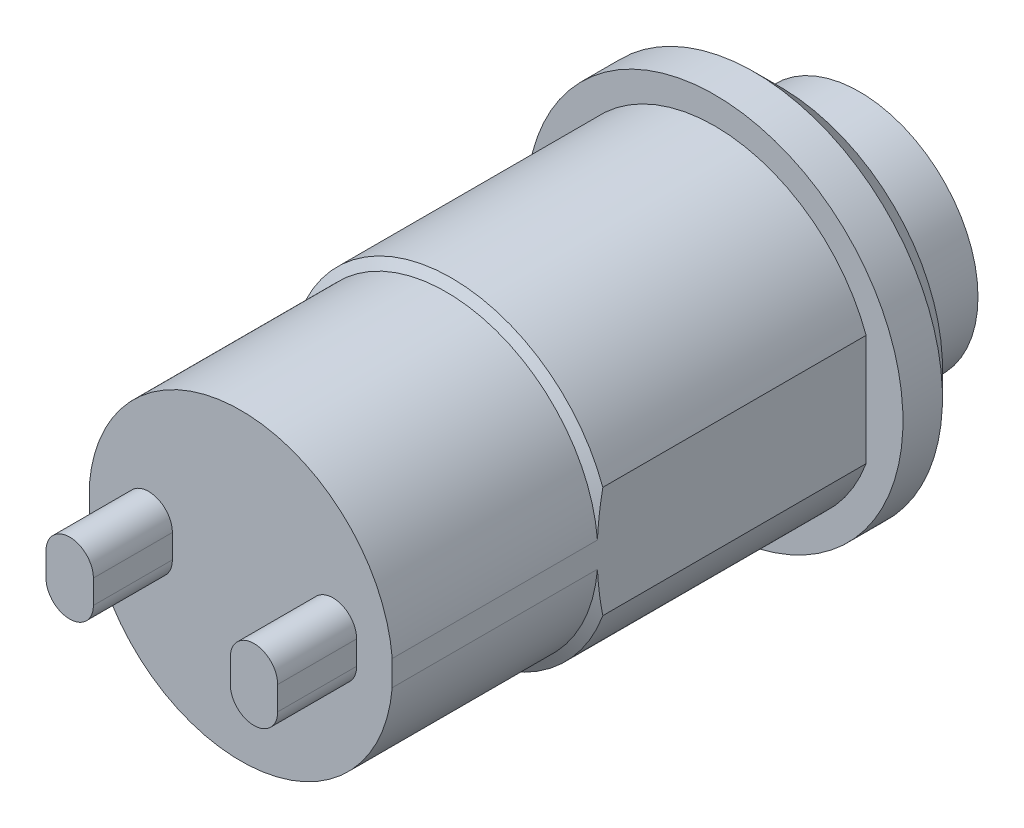
ISO-10303-21;
HEADER;
FILE_DESCRIPTION(('STEP AP214'),'2;1');
FILE_NAME('part.step','',(''),(''),'','','');
FILE_SCHEMA(('AUTOMOTIVE_DESIGN { 1 0 10303 214 1 1 1 1 }'));
ENDSEC;
DATA;
#1=APPLICATION_CONTEXT('core data for automotive mechanical design processes');
#2=APPLICATION_PROTOCOL_DEFINITION('international standard','automotive_design',2000,#1);
#3=PRODUCT_CONTEXT('',#1,'mechanical');
#4=PRODUCT('Part','Part','',(#3));
#5=PRODUCT_RELATED_PRODUCT_CATEGORY('part','',(#4));
#6=PRODUCT_DEFINITION_FORMATION('','',#4);
#7=PRODUCT_DEFINITION_CONTEXT('part definition',#1,'design');
#8=PRODUCT_DEFINITION('design','',#6,#7);
#9=PRODUCT_DEFINITION_SHAPE('','',#8);
#10=(LENGTH_UNIT() NAMED_UNIT(*) SI_UNIT(.MILLI.,.METRE.));
#11=(NAMED_UNIT(*) PLANE_ANGLE_UNIT() SI_UNIT($,.RADIAN.));
#12=(NAMED_UNIT(*) SI_UNIT($,.STERADIAN.) SOLID_ANGLE_UNIT());
#13=UNCERTAINTY_MEASURE_WITH_UNIT(LENGTH_MEASURE(1.E-05),#10,'distance_accuracy_value','');
#14=(GEOMETRIC_REPRESENTATION_CONTEXT(3) GLOBAL_UNCERTAINTY_ASSIGNED_CONTEXT((#13)) GLOBAL_UNIT_ASSIGNED_CONTEXT((#10,
#11,#12)) REPRESENTATION_CONTEXT('',''));
#15=CARTESIAN_POINT('',(0.,0.,0.));
#16=DIRECTION('',(0.,0.,1.));
#17=DIRECTION('',(1.,0.,0.));
#18=AXIS2_PLACEMENT_3D('',#15,#16,#17);
#19=CARTESIAN_POINT('',(0.,0.,-49.6568329421243));
#20=DIRECTION('',(0.,0.,-1.));
#21=DIRECTION('',(-1.,0.,0.));
#22=AXIS2_PLACEMENT_3D('',#19,#20,#21);
#23=CYLINDRICAL_SURFACE('',#22,6.12500000000001);
#24=CARTESIAN_POINT('',(0.,0.,10.));
#25=DIRECTION('',(0.,0.,-1.));
#26=DIRECTION('',(-1.,0.,0.));
#27=AXIS2_PLACEMENT_3D('',#24,#25,#26);
#28=CIRCLE('',#27,6.12500000000001);
#29=CARTESIAN_POINT('',(-5.75,2.11024287701679,10.));
#30=VERTEX_POINT('',#29);
#31=CARTESIAN_POINT('',(5.75,2.11024287701679,10.));
#32=VERTEX_POINT('',#31);
#33=EDGE_CURVE('E181',#30,#32,#28,.T.);
#34=ORIENTED_EDGE('',*,*,#33,.T.);
#35=DIRECTION('',(0.,0.,1.));
#36=VECTOR('',#35,1.);
#37=CARTESIAN_POINT('',(5.75,2.11024287701679,-4.2371128141696));
#38=LINE('',#37,#36);
#39=CARTESIAN_POINT('',(5.75,2.11024287701679,0.));
#40=VERTEX_POINT('',#39);
#41=EDGE_CURVE('E167',#40,#32,#38,.T.);
#42=ORIENTED_EDGE('',*,*,#41,.F.);
#43=CARTESIAN_POINT('',(0.,0.,0.));
#44=DIRECTION('',(0.,0.,-1.));
#45=DIRECTION('',(-1.,0.,0.));
#46=AXIS2_PLACEMENT_3D('',#43,#44,#45);
#47=CIRCLE('',#46,6.12500000000001);
#48=CARTESIAN_POINT('',(-5.75,2.11024287701679,0.));
#49=VERTEX_POINT('',#48);
#50=EDGE_CURVE('E176',#49,#40,#47,.T.);
#51=ORIENTED_EDGE('',*,*,#50,.F.);
#52=DIRECTION('',(0.,0.,1.));
#53=VECTOR('',#52,1.);
#54=CARTESIAN_POINT('',(-5.75,2.11024287701679,-4.2371128141696));
#55=LINE('',#54,#53);
#56=EDGE_CURVE('E584',#49,#30,#55,.T.);
#57=ORIENTED_EDGE('',*,*,#56,.T.);
#58=EDGE_LOOP('',(#34,#42,#51,#57));
#59=FACE_BOUND('',#58,.T.);
#60=ADVANCED_FACE('F45',(#59),#23,.T.);
#61=CARTESIAN_POINT('',(0.,0.,10.2049593455623));
#62=DIRECTION('',(0.,0.,-1.));
#63=DIRECTION('',(-1.,0.,0.));
#64=AXIS2_PLACEMENT_3D('',#61,#62,#63);
#65=CONICAL_SURFACE('',#64,5.77000000000001,1.04719755119661);
#66=CARTESIAN_POINT('',(5.75,-2.11024287701679,10.));
#67=VERTEX_POINT('',#66);
#68=CARTESIAN_POINT('',(-5.75,-2.11024287701679,10.));
#69=VERTEX_POINT('',#68);
#70=EDGE_CURVE('E185',#67,#69,#28,.T.);
#71=ORIENTED_EDGE('',*,*,#70,.F.);
#72=CARTESIAN_POINT('',(5.75,-2.11094287701679,9.99986073972885));
#73=CARTESIAN_POINT('',(5.75,-1.97362625151507,10.0271913681319));
#74=CARTESIAN_POINT('',(5.75,-1.83584357008723,10.0522492398615));
#75=CARTESIAN_POINT('',(5.75,-1.55944069758245,10.0974319539955));
#76=CARTESIAN_POINT('',(5.75,-1.42082031733226,10.1175556359621));
#77=CARTESIAN_POINT('',(5.75,-1.14284252177679,10.1524766254936));
#78=CARTESIAN_POINT('',(5.75,-1.00348481953381,10.1672716766164));
#79=CARTESIAN_POINT('',(5.75,-0.724303795555837,10.1912228123099));
#80=CARTESIAN_POINT('',(5.75,-0.584480516138516,10.20037939603));
#81=CARTESIAN_POINT('',(5.75,-0.168948851655554,10.2188503830837));
#82=CARTESIAN_POINT('',(5.75,0.107184374453622,10.2197253485683));
#83=CARTESIAN_POINT('',(5.75,0.658394032800849,10.1985909668815));
#84=CARTESIAN_POINT('',(5.75,0.933470993550755,10.1765951564037));
#85=CARTESIAN_POINT('',(5.75,1.28280194150757,10.1351644665691));
#86=CARTESIAN_POINT('',(5.75,1.35829659132565,10.1254001697001));
#87=CARTESIAN_POINT('',(5.75,1.50906621154096,10.1043398016968));
#88=CARTESIAN_POINT('',(5.75,1.58434120759044,10.0930439173938));
#89=CARTESIAN_POINT('',(5.75,1.73498529824519,10.0689269990814));
#90=CARTESIAN_POINT('',(5.75,1.81035334481151,10.0560994612025));
#91=CARTESIAN_POINT('',(5.75,1.96084025697072,10.0290264309476));
#92=CARTESIAN_POINT('',(5.75,2.03595910384655,10.014780834448));
#93=CARTESIAN_POINT('',(5.75,2.11094287701679,9.99986073972885));
#94=B_SPLINE_CURVE_WITH_KNOTS('',3,(#72,#73,#74,#75,#76,#77,#78,#79,#80,#81,#82,#83,#84,#85,#86,
#87,#88,#89,#90,#91,#92,#93),.UNSPECIFIED.,.F.,.F.,(4,2,2,2,2,2,2,2,2,2,4),(0.,
0.420030554474528,0.840159798478734,1.26046674025352,1.68073646869493,2.50812065878773,
3.33501541755115,3.56337896676642,3.79171468396149,4.02105698408979,4.25041613655785),.UNSPECIFIED.);
#95=CARTESIAN_POINT('',(5.75,-0.480000000000096,10.2049593455623));
#96=VERTEX_POINT('',#95);
#97=EDGE_CURVE('E162',#67,#96,#94,.T.);
#98=ORIENTED_EDGE('',*,*,#97,.T.);
#99=CARTESIAN_POINT('',(0.,0.,10.2049593455623));
#100=DIRECTION('',(0.,0.,-1.));
#101=DIRECTION('',(-1.,0.,0.));
#102=AXIS2_PLACEMENT_3D('',#99,#100,#101);
#103=CIRCLE('',#102,5.77000000000001);
#104=CARTESIAN_POINT('',(-5.75,-0.480000000000096,10.2049593455623));
#105=VERTEX_POINT('',#104);
#106=EDGE_CURVE('E202',#96,#105,#103,.T.);
#107=ORIENTED_EDGE('',*,*,#106,.T.);
#108=CARTESIAN_POINT('',(-5.75,2.11094287701679,9.99986073972885));
#109=CARTESIAN_POINT('',(-5.75,1.97362625151507,10.0271913681319));
#110=CARTESIAN_POINT('',(-5.75,1.83584357008723,10.0522492398615));
#111=CARTESIAN_POINT('',(-5.75,1.55944069758245,10.0974319539955));
#112=CARTESIAN_POINT('',(-5.75,1.42082031733226,10.1175556359621));
#113=CARTESIAN_POINT('',(-5.75,1.14284252177679,10.1524766254936));
#114=CARTESIAN_POINT('',(-5.75,1.00348481953381,10.1672716766164));
#115=CARTESIAN_POINT('',(-5.75,0.724303795555837,10.1912228123099));
#116=CARTESIAN_POINT('',(-5.75,0.584480516138516,10.20037939603));
#117=CARTESIAN_POINT('',(-5.75,0.168948851655554,10.2188503830837));
#118=CARTESIAN_POINT('',(-5.75,-0.107184374453622,10.2197253485683));
#119=CARTESIAN_POINT('',(-5.75,-0.658394032800849,10.1985909668815));
#120=CARTESIAN_POINT('',(-5.75,-0.933470993550755,10.1765951564037));
#121=CARTESIAN_POINT('',(-5.75,-1.28280194150757,10.1351644665691));
#122=CARTESIAN_POINT('',(-5.75,-1.35829659132565,10.1254001697001));
#123=CARTESIAN_POINT('',(-5.75,-1.50906621154096,10.1043398016968));
#124=CARTESIAN_POINT('',(-5.75,-1.58434120759044,10.0930439173938));
#125=CARTESIAN_POINT('',(-5.75,-1.73498529824519,10.0689269990814));
#126=CARTESIAN_POINT('',(-5.75,-1.81035334481151,10.0560994612025));
#127=CARTESIAN_POINT('',(-5.75,-1.96084025697072,10.0290264309476));
#128=CARTESIAN_POINT('',(-5.75,-2.03595910384655,10.014780834448));
#129=CARTESIAN_POINT('',(-5.75,-2.11094287701679,9.99986073972885));
#130=B_SPLINE_CURVE_WITH_KNOTS('',3,(#108,#109,#110,#111,#112,#113,#114,#115,#116,#117,#118,
#119,#120,#121,#122,#123,#124,#125,#126,#127,#128,#129),.UNSPECIFIED.,.F.,.F.,(4,2,2,2,2,2,2,2,
2,2,4),(0.,0.420030554474528,0.840159798478734,1.26046674025352,1.68073646869493,
2.50812065878773,3.33501541755115,3.56337896676642,3.79171468396149,4.02105698408979,
4.25041613655785),.UNSPECIFIED.);
#131=EDGE_CURVE('E224',#105,#69,#130,.T.);
#132=ORIENTED_EDGE('',*,*,#131,.T.);
#133=EDGE_LOOP('',(#71,#98,#107,#132));
#134=FACE_BOUND('',#133,.T.);
#135=ADVANCED_FACE('F223',(#134),#65,.T.);
#136=CARTESIAN_POINT('',(0.,0.,-49.6568329421243));
#137=DIRECTION('',(0.,0.,-1.));
#138=DIRECTION('',(-1.,0.,0.));
#139=AXIS2_PLACEMENT_3D('',#136,#137,#138);
#140=CYLINDRICAL_SURFACE('',#139,5.77000000000001);
#141=CARTESIAN_POINT('',(0.,0.,18.));
#142=DIRECTION('',(0.,0.,-1.));
#143=DIRECTION('',(-1.,0.,0.));
#144=AXIS2_PLACEMENT_3D('',#141,#142,#143);
#145=CIRCLE('',#144,5.77000000000001);
#146=CARTESIAN_POINT('',(-5.75,0.480000000000096,18.));
#147=VERTEX_POINT('',#146);
#148=CARTESIAN_POINT('',(5.75,0.480000000000096,18.));
#149=VERTEX_POINT('',#148);
#150=EDGE_CURVE('E208',#147,#149,#145,.T.);
#151=ORIENTED_EDGE('',*,*,#150,.T.);
#152=DIRECTION('',(0.,0.,-1.));
#153=VECTOR('',#152,1.);
#154=CARTESIAN_POINT('',(5.75,0.480000000000096,-49.6568329421243));
#155=LINE('',#154,#153);
#156=CARTESIAN_POINT('',(5.75,0.480000000000096,10.2049593455623));
#157=VERTEX_POINT('',#156);
#158=EDGE_CURVE('E11',#149,#157,#155,.T.);
#159=ORIENTED_EDGE('',*,*,#158,.T.);
#160=CARTESIAN_POINT('',(-5.75,0.480000000000096,10.2049593455623));
#161=VERTEX_POINT('',#160);
#162=EDGE_CURVE('E215',#161,#157,#103,.T.);
#163=ORIENTED_EDGE('',*,*,#162,.F.);
#164=DIRECTION('',(0.,0.,-1.));
#165=VECTOR('',#164,1.);
#166=CARTESIAN_POINT('',(-5.75,0.480000000000096,-49.6568329421243));
#167=LINE('',#166,#165);
#168=EDGE_CURVE('E191',#161,#147,#167,.F.);
#169=ORIENTED_EDGE('',*,*,#168,.T.);
#170=EDGE_LOOP('',(#151,#159,#163,#169));
#171=FACE_BOUND('',#170,.T.);
#172=ADVANCED_FACE('F312',(#171),#140,.T.);
#173=CARTESIAN_POINT('',(5.77000000000001,0.,18.));
#174=DIRECTION('',(0.,0.,-1.));
#175=DIRECTION('',(-1.,0.,0.));
#176=AXIS2_PLACEMENT_3D('',#173,#174,#175);
#177=PLANE('',#176);
#178=DIRECTION('',(0.,-1.,0.));
#179=VECTOR('',#178,1.);
#180=CARTESIAN_POINT('',(-2.6,-0.45,18.));
#181=LINE('',#180,#179);
#182=CARTESIAN_POINT('',(-2.6,0.45,18.));
#183=VERTEX_POINT('',#182);
#184=CARTESIAN_POINT('',(-2.6,-0.45,18.));
#185=VERTEX_POINT('',#184);
#186=EDGE_CURVE('E402',#183,#185,#181,.T.);
#187=ORIENTED_EDGE('',*,*,#186,.T.);
#188=CARTESIAN_POINT('',(-3.5,-0.45,18.));
#189=DIRECTION('',(0.,0.,-1.));
#190=DIRECTION('',(-1.,0.,0.));
#191=AXIS2_PLACEMENT_3D('',#188,#189,#190);
#192=CIRCLE('',#191,0.899999999999999);
#193=CARTESIAN_POINT('',(-4.4,-0.45,18.));
#194=VERTEX_POINT('',#193);
#195=EDGE_CURVE('E227',#185,#194,#192,.T.);
#196=ORIENTED_EDGE('',*,*,#195,.T.);
#197=DIRECTION('',(0.,1.,0.));
#198=VECTOR('',#197,1.);
#199=CARTESIAN_POINT('',(-4.4,-0.45,18.));
#200=LINE('',#199,#198);
#201=CARTESIAN_POINT('',(-4.4,0.45,18.));
#202=VERTEX_POINT('',#201);
#203=EDGE_CURVE('E396',#194,#202,#200,.T.);
#204=ORIENTED_EDGE('',*,*,#203,.T.);
#205=CARTESIAN_POINT('',(-3.5,0.45,18.));
#206=DIRECTION('',(0.,0.,-1.));
#207=DIRECTION('',(-1.,0.,0.));
#208=AXIS2_PLACEMENT_3D('',#205,#206,#207);
#209=CIRCLE('',#208,0.899999999999999);
#210=EDGE_CURVE('E399',#202,#183,#209,.T.);
#211=ORIENTED_EDGE('',*,*,#210,.T.);
#212=EDGE_LOOP('',(#187,#196,#204,#211));
#213=FACE_BOUND('',#212,.T.);
#214=CARTESIAN_POINT('',(5.75,-0.480000000000096,18.));
#215=VERTEX_POINT('',#214);
#216=CARTESIAN_POINT('',(-5.75,-0.480000000000096,18.));
#217=VERTEX_POINT('',#216);
#218=EDGE_CURVE('E200',#215,#217,#145,.T.);
#219=ORIENTED_EDGE('',*,*,#218,.F.);
#220=DIRECTION('',(0.,-1.,0.));
#221=VECTOR('',#220,1.);
#222=CARTESIAN_POINT('',(5.75,2.11024287701679,18.));
#223=LINE('',#222,#221);
#224=EDGE_CURVE('E60',#149,#215,#223,.T.);
#225=ORIENTED_EDGE('',*,*,#224,.F.);
#226=ORIENTED_EDGE('',*,*,#150,.F.);
#227=DIRECTION('',(0.,1.,0.));
#228=VECTOR('',#227,1.);
#229=CARTESIAN_POINT('',(-5.75,2.11024287701679,18.));
#230=LINE('',#229,#228);
#231=EDGE_CURVE('E68',#217,#147,#230,.T.);
#232=ORIENTED_EDGE('',*,*,#231,.F.);
#233=EDGE_LOOP('',(#219,#225,#226,#232));
#234=FACE_BOUND('',#233,.T.);
#235=CARTESIAN_POINT('',(3.5,-0.45,18.));
#236=DIRECTION('',(0.,0.,1.));
#237=DIRECTION('',(1.,0.,0.));
#238=AXIS2_PLACEMENT_3D('',#235,#236,#237);
#239=CIRCLE('',#238,0.899999999999999);
#240=CARTESIAN_POINT('',(2.6,-0.45,18.));
#241=VERTEX_POINT('',#240);
#242=CARTESIAN_POINT('',(4.4,-0.45,18.));
#243=VERTEX_POINT('',#242);
#244=EDGE_CURVE('E376',#241,#243,#239,.T.);
#245=ORIENTED_EDGE('',*,*,#244,.F.);
#246=DIRECTION('',(0.,-1.,0.));
#247=VECTOR('',#246,1.);
#248=CARTESIAN_POINT('',(2.6,-0.45,18.));
#249=LINE('',#248,#247);
#250=CARTESIAN_POINT('',(2.6,0.45,18.));
#251=VERTEX_POINT('',#250);
#252=EDGE_CURVE('E366',#251,#241,#249,.T.);
#253=ORIENTED_EDGE('',*,*,#252,.F.);
#254=CARTESIAN_POINT('',(3.5,0.45,18.));
#255=DIRECTION('',(0.,0.,1.));
#256=DIRECTION('',(1.,0.,0.));
#257=AXIS2_PLACEMENT_3D('',#254,#255,#256);
#258=CIRCLE('',#257,0.899999999999999);
#259=CARTESIAN_POINT('',(4.4,0.45,18.));
#260=VERTEX_POINT('',#259);
#261=EDGE_CURVE('E370',#260,#251,#258,.T.);
#262=ORIENTED_EDGE('',*,*,#261,.F.);
#263=DIRECTION('',(0.,1.,0.));
#264=VECTOR('',#263,1.);
#265=CARTESIAN_POINT('',(4.4,-0.45,18.));
#266=LINE('',#265,#264);
#267=EDGE_CURVE('E373',#243,#260,#266,.T.);
#268=ORIENTED_EDGE('',*,*,#267,.F.);
#269=EDGE_LOOP('',(#245,#253,#262,#268));
#270=FACE_BOUND('',#269,.T.);
#271=ADVANCED_FACE('F204',(#213,#234,#270),#177,.F.);
#272=CARTESIAN_POINT('',(0.,0.,-49.6568329421243));
#273=DIRECTION('',(0.,0.,-1.));
#274=DIRECTION('',(-1.,0.,0.));
#275=AXIS2_PLACEMENT_3D('',#272,#273,#274);
#276=CYLINDRICAL_SURFACE('',#275,7.15);
#277=CARTESIAN_POINT('',(0.,0.,-1.5));
#278=DIRECTION('',(0.,0.,-1.));
#279=DIRECTION('',(-1.,0.,0.));
#280=AXIS2_PLACEMENT_3D('',#277,#278,#279);
#281=CIRCLE('',#280,7.15);
#282=CARTESIAN_POINT('',(-7.15,0.,-1.5));
#283=VERTEX_POINT('',#282);
#284=EDGE_CURVE('E341',#283,#283,#281,.T.);
#285=ORIENTED_EDGE('',*,*,#284,.F.);
#286=EDGE_LOOP('',(#285));
#287=FACE_BOUND('',#286,.T.);
#288=CARTESIAN_POINT('',(0.,0.,0.));
#289=DIRECTION('',(0.,0.,-1.));
#290=DIRECTION('',(-1.,0.,0.));
#291=AXIS2_PLACEMENT_3D('',#288,#289,#290);
#292=CIRCLE('',#291,7.15);
#293=CARTESIAN_POINT('',(-7.15,0.,0.));
#294=VERTEX_POINT('',#293);
#295=EDGE_CURVE('E183',#294,#294,#292,.T.);
#296=ORIENTED_EDGE('',*,*,#295,.T.);
#297=EDGE_LOOP('',(#296));
#298=FACE_BOUND('',#297,.T.);
#299=ADVANCED_FACE('F47',(#287,#298),#276,.T.);
#300=CARTESIAN_POINT('',(7.15,0.,0.));
#301=DIRECTION('',(0.,0.,-1.));
#302=DIRECTION('',(-1.,0.,0.));
#303=AXIS2_PLACEMENT_3D('',#300,#301,#302);
#304=PLANE('',#303);
#305=ORIENTED_EDGE('',*,*,#295,.F.);
#306=EDGE_LOOP('',(#305));
#307=FACE_BOUND('',#306,.T.);
#308=ORIENTED_EDGE('',*,*,#50,.T.);
#309=DIRECTION('',(0.,-1.,0.));
#310=VECTOR('',#309,1.);
#311=CARTESIAN_POINT('',(5.75,2.11024287701679,0.));
#312=LINE('',#311,#310);
#313=CARTESIAN_POINT('',(5.75,-2.11024287701679,0.));
#314=VERTEX_POINT('',#313);
#315=EDGE_CURVE('E159',#40,#314,#312,.T.);
#316=ORIENTED_EDGE('',*,*,#315,.T.);
#317=CARTESIAN_POINT('',(-5.75,-2.11024287701679,0.));
#318=VERTEX_POINT('',#317);
#319=EDGE_CURVE('E174',#314,#318,#47,.T.);
#320=ORIENTED_EDGE('',*,*,#319,.T.);
#321=DIRECTION('',(0.,1.,0.));
#322=VECTOR('',#321,1.);
#323=CARTESIAN_POINT('',(-5.75,2.11024287701679,0.));
#324=LINE('',#323,#322);
#325=EDGE_CURVE('E589',#318,#49,#324,.T.);
#326=ORIENTED_EDGE('',*,*,#325,.T.);
#327=EDGE_LOOP('',(#308,#316,#320,#326));
#328=FACE_BOUND('',#327,.T.);
#329=ADVANCED_FACE('F172',(#307,#328),#304,.F.);
#330=ORIENTED_EDGE('',*,*,#319,.F.);
#331=DIRECTION('',(0.,0.,1.));
#332=VECTOR('',#331,1.);
#333=CARTESIAN_POINT('',(5.75,-2.11024287701679,-4.2371128141696));
#334=LINE('',#333,#332);
#335=EDGE_CURVE('E156',#314,#67,#334,.T.);
#336=ORIENTED_EDGE('',*,*,#335,.T.);
#337=ORIENTED_EDGE('',*,*,#70,.T.);
#338=DIRECTION('',(0.,0.,1.));
#339=VECTOR('',#338,1.);
#340=CARTESIAN_POINT('',(-5.75,-2.11024287701679,-4.2371128141696));
#341=LINE('',#340,#339);
#342=EDGE_CURVE('E180',#318,#69,#341,.T.);
#343=ORIENTED_EDGE('',*,*,#342,.F.);
#344=EDGE_LOOP('',(#330,#336,#337,#343));
#345=FACE_BOUND('',#344,.T.);
#346=ADVANCED_FACE('F179',(#345),#23,.T.);
#347=ORIENTED_EDGE('',*,*,#162,.T.);
#348=EDGE_CURVE('E225',#157,#32,#94,.T.);
#349=ORIENTED_EDGE('',*,*,#348,.T.);
#350=ORIENTED_EDGE('',*,*,#33,.F.);
#351=EDGE_CURVE('E228',#30,#161,#130,.T.);
#352=ORIENTED_EDGE('',*,*,#351,.T.);
#353=EDGE_LOOP('',(#347,#349,#350,#352));
#354=FACE_BOUND('',#353,.T.);
#355=ADVANCED_FACE('F245',(#354),#65,.T.);
#356=ORIENTED_EDGE('',*,*,#106,.F.);
#357=DIRECTION('',(0.,0.,-1.));
#358=VECTOR('',#357,1.);
#359=CARTESIAN_POINT('',(5.75,-0.480000000000096,-49.6568329421243));
#360=LINE('',#359,#358);
#361=EDGE_CURVE('E53',#96,#215,#360,.F.);
#362=ORIENTED_EDGE('',*,*,#361,.T.);
#363=ORIENTED_EDGE('',*,*,#218,.T.);
#364=DIRECTION('',(0.,0.,-1.));
#365=VECTOR('',#364,1.);
#366=CARTESIAN_POINT('',(-5.75,-0.480000000000096,-49.6568329421243));
#367=LINE('',#366,#365);
#368=EDGE_CURVE('E193',#217,#105,#367,.T.);
#369=ORIENTED_EDGE('',*,*,#368,.T.);
#370=EDGE_LOOP('',(#356,#362,#363,#369));
#371=FACE_BOUND('',#370,.T.);
#372=ADVANCED_FACE('F199',(#371),#140,.T.);
#373=CARTESIAN_POINT('',(0.,0.,11.0750000000001));
#374=DIRECTION('',(0.,0.,-1.));
#375=DIRECTION('',(1.,0.,0.));
#376=AXIS2_PLACEMENT_3D('',#373,#374,#375);
#377=SPHERICAL_SURFACE('',#376,17.1750000000001);
#378=CARTESIAN_POINT('',(0.,0.,-5.50000000000001));
#379=DIRECTION('',(0.,0.,-1.));
#380=DIRECTION('',(-1.,0.,0.));
#381=AXIS2_PLACEMENT_3D('',#378,#379,#380);
#382=CIRCLE('',#381,4.5);
#383=CARTESIAN_POINT('',(-4.5,0.,-5.50000000000001));
#384=VERTEX_POINT('',#383);
#385=EDGE_CURVE('E209',#384,#384,#382,.T.);
#386=ORIENTED_EDGE('',*,*,#385,.T.);
#387=EDGE_LOOP('',(#386));
#388=FACE_BOUND('',#387,.T.);
#389=ADVANCED_FACE('F306',(#388),#377,.T.);
#390=CARTESIAN_POINT('',(0.,0.,-49.6568329421243));
#391=DIRECTION('',(0.,0.,-1.));
#392=DIRECTION('',(-1.,0.,0.));
#393=AXIS2_PLACEMENT_3D('',#390,#391,#392);
#394=CYLINDRICAL_SURFACE('',#393,4.5);
#395=ORIENTED_EDGE('',*,*,#385,.F.);
#396=EDGE_LOOP('',(#395));
#397=FACE_BOUND('',#396,.T.);
#398=CARTESIAN_POINT('',(0.,0.,-2.5));
#399=DIRECTION('',(0.,0.,-1.));
#400=DIRECTION('',(-1.,0.,0.));
#401=AXIS2_PLACEMENT_3D('',#398,#399,#400);
#402=CIRCLE('',#401,4.5);
#403=CARTESIAN_POINT('',(-4.5,0.,-2.5));
#404=VERTEX_POINT('',#403);
#405=EDGE_CURVE('E212',#404,#404,#402,.T.);
#406=ORIENTED_EDGE('',*,*,#405,.T.);
#407=EDGE_LOOP('',(#406));
#408=FACE_BOUND('',#407,.T.);
#409=ADVANCED_FACE('F302',(#397,#408),#394,.T.);
#410=CARTESIAN_POINT('',(6.15,0.,-2.5));
#411=DIRECTION('',(0.,0.,1.));
#412=DIRECTION('',(1.,0.,0.));
#413=AXIS2_PLACEMENT_3D('',#410,#411,#412);
#414=PLANE('',#413);
#415=ORIENTED_EDGE('',*,*,#405,.F.);
#416=EDGE_LOOP('',(#415));
#417=FACE_BOUND('',#416,.T.);
#418=CARTESIAN_POINT('',(0.,0.,-2.5));
#419=DIRECTION('',(0.,0.,-1.));
#420=DIRECTION('',(-1.,0.,0.));
#421=AXIS2_PLACEMENT_3D('',#418,#419,#420);
#422=CIRCLE('',#421,6.15);
#423=CARTESIAN_POINT('',(-6.15,0.,-2.5));
#424=VERTEX_POINT('',#423);
#425=EDGE_CURVE('E343',#424,#424,#422,.T.);
#426=ORIENTED_EDGE('',*,*,#425,.T.);
#427=EDGE_LOOP('',(#426));
#428=FACE_BOUND('',#427,.T.);
#429=ADVANCED_FACE('F298',(#417,#428),#414,.F.);
#430=CARTESIAN_POINT('',(0.,0.,-1.5));
#431=DIRECTION('',(0.,0.,1.));
#432=DIRECTION('',(1.,0.,0.));
#433=AXIS2_PLACEMENT_3D('',#430,#431,#432);
#434=CONICAL_SURFACE('',#433,7.15,0.78539816339745);
#435=ORIENTED_EDGE('',*,*,#425,.F.);
#436=EDGE_LOOP('',(#435));
#437=FACE_BOUND('',#436,.T.);
#438=ORIENTED_EDGE('',*,*,#284,.T.);
#439=EDGE_LOOP('',(#438));
#440=FACE_BOUND('',#439,.T.);
#441=ADVANCED_FACE('F294',(#437,#440),#434,.T.);
#442=CARTESIAN_POINT('',(3.5,-0.45,21.));
#443=DIRECTION('',(0.,0.,-1.));
#444=DIRECTION('',(-1.,0.,0.));
#445=AXIS2_PLACEMENT_3D('',#442,#443,#444);
#446=CYLINDRICAL_SURFACE('',#445,0.899999999999999);
#447=ORIENTED_EDGE('',*,*,#244,.T.);
#448=DIRECTION('',(0.,0.,-1.));
#449=VECTOR('',#448,1.);
#450=CARTESIAN_POINT('',(4.4,-0.45,21.));
#451=LINE('',#450,#449);
#452=CARTESIAN_POINT('',(4.4,-0.45,21.));
#453=VERTEX_POINT('',#452);
#454=EDGE_CURVE('E344',#453,#243,#451,.T.);
#455=ORIENTED_EDGE('',*,*,#454,.F.);
#456=CARTESIAN_POINT('',(3.5,-0.45,21.));
#457=DIRECTION('',(0.,0.,1.));
#458=DIRECTION('',(1.,0.,0.));
#459=AXIS2_PLACEMENT_3D('',#456,#457,#458);
#460=CIRCLE('',#459,0.899999999999999);
#461=CARTESIAN_POINT('',(2.6,-0.45,21.));
#462=VERTEX_POINT('',#461);
#463=EDGE_CURVE('E369',#462,#453,#460,.T.);
#464=ORIENTED_EDGE('',*,*,#463,.F.);
#465=DIRECTION('',(0.,0.,-1.));
#466=VECTOR('',#465,1.);
#467=CARTESIAN_POINT('',(2.6,-0.45,21.));
#468=LINE('',#467,#466);
#469=EDGE_CURVE('E362',#462,#241,#468,.T.);
#470=ORIENTED_EDGE('',*,*,#469,.T.);
#471=EDGE_LOOP('',(#447,#455,#464,#470));
#472=FACE_BOUND('',#471,.T.);
#473=ADVANCED_FACE('F290',(#472),#446,.T.);
#474=CARTESIAN_POINT('',(4.4,-0.45,21.));
#475=DIRECTION('',(-1.,0.,0.));
#476=DIRECTION('',(0.,0.,1.));
#477=AXIS2_PLACEMENT_3D('',#474,#475,#476);
#478=PLANE('',#477);
#479=ORIENTED_EDGE('',*,*,#267,.T.);
#480=DIRECTION('',(0.,0.,-1.));
#481=VECTOR('',#480,1.);
#482=CARTESIAN_POINT('',(4.4,0.45,21.));
#483=LINE('',#482,#481);
#484=CARTESIAN_POINT('',(4.4,0.45,21.));
#485=VERTEX_POINT('',#484);
#486=EDGE_CURVE('E349',#485,#260,#483,.T.);
#487=ORIENTED_EDGE('',*,*,#486,.F.);
#488=DIRECTION('',(0.,1.,0.));
#489=VECTOR('',#488,1.);
#490=CARTESIAN_POINT('',(4.4,-0.45,21.));
#491=LINE('',#490,#489);
#492=EDGE_CURVE('E383',#453,#485,#491,.T.);
#493=ORIENTED_EDGE('',*,*,#492,.F.);
#494=ORIENTED_EDGE('',*,*,#454,.T.);
#495=EDGE_LOOP('',(#479,#487,#493,#494));
#496=FACE_BOUND('',#495,.T.);
#497=ADVANCED_FACE('F286',(#496),#478,.F.);
#498=CARTESIAN_POINT('',(3.5,0.45,21.));
#499=DIRECTION('',(0.,0.,-1.));
#500=DIRECTION('',(-1.,0.,0.));
#501=AXIS2_PLACEMENT_3D('',#498,#499,#500);
#502=CYLINDRICAL_SURFACE('',#501,0.899999999999999);
#503=ORIENTED_EDGE('',*,*,#261,.T.);
#504=DIRECTION('',(0.,0.,-1.));
#505=VECTOR('',#504,1.);
#506=CARTESIAN_POINT('',(2.6,0.45,21.));
#507=LINE('',#506,#505);
#508=CARTESIAN_POINT('',(2.6,0.45,21.));
#509=VERTEX_POINT('',#508);
#510=EDGE_CURVE('E359',#509,#251,#507,.T.);
#511=ORIENTED_EDGE('',*,*,#510,.F.);
#512=CARTESIAN_POINT('',(3.5,0.45,21.));
#513=DIRECTION('',(0.,0.,1.));
#514=DIRECTION('',(1.,0.,0.));
#515=AXIS2_PLACEMENT_3D('',#512,#513,#514);
#516=CIRCLE('',#515,0.899999999999999);
#517=EDGE_CURVE('E381',#485,#509,#516,.T.);
#518=ORIENTED_EDGE('',*,*,#517,.F.);
#519=ORIENTED_EDGE('',*,*,#486,.T.);
#520=EDGE_LOOP('',(#503,#511,#518,#519));
#521=FACE_BOUND('',#520,.T.);
#522=ADVANCED_FACE('F282',(#521),#502,.T.);
#523=CARTESIAN_POINT('',(2.6,-0.45,21.));
#524=DIRECTION('',(1.,0.,0.));
#525=DIRECTION('',(0.,0.,-1.));
#526=AXIS2_PLACEMENT_3D('',#523,#524,#525);
#527=PLANE('',#526);
#528=ORIENTED_EDGE('',*,*,#252,.T.);
#529=ORIENTED_EDGE('',*,*,#469,.F.);
#530=DIRECTION('',(0.,-1.,0.));
#531=VECTOR('',#530,1.);
#532=CARTESIAN_POINT('',(2.6,-0.45,21.));
#533=LINE('',#532,#531);
#534=EDGE_CURVE('E365',#509,#462,#533,.T.);
#535=ORIENTED_EDGE('',*,*,#534,.F.);
#536=ORIENTED_EDGE('',*,*,#510,.T.);
#537=EDGE_LOOP('',(#528,#529,#535,#536));
#538=FACE_BOUND('',#537,.T.);
#539=ADVANCED_FACE('F278',(#538),#527,.F.);
#540=CARTESIAN_POINT('',(3.5,-0.45,21.));
#541=DIRECTION('',(0.,0.,1.));
#542=DIRECTION('',(1.,0.,0.));
#543=AXIS2_PLACEMENT_3D('',#540,#541,#542);
#544=PLANE('',#543);
#545=ORIENTED_EDGE('',*,*,#463,.T.);
#546=ORIENTED_EDGE('',*,*,#492,.T.);
#547=ORIENTED_EDGE('',*,*,#517,.T.);
#548=ORIENTED_EDGE('',*,*,#534,.T.);
#549=EDGE_LOOP('',(#545,#546,#547,#548));
#550=FACE_BOUND('',#549,.T.);
#551=ADVANCED_FACE('F274',(#550),#544,.T.);
#552=CARTESIAN_POINT('',(-3.5,-0.45,21.));
#553=DIRECTION('',(0.,0.,-1.));
#554=DIRECTION('',(-1.,0.,0.));
#555=AXIS2_PLACEMENT_3D('',#552,#553,#554);
#556=CYLINDRICAL_SURFACE('',#555,0.899999999999999);
#557=ORIENTED_EDGE('',*,*,#195,.F.);
#558=DIRECTION('',(0.,0.,-1.));
#559=VECTOR('',#558,1.);
#560=CARTESIAN_POINT('',(-2.6,-0.45,21.));
#561=LINE('',#560,#559);
#562=CARTESIAN_POINT('',(-2.6,-0.45,21.));
#563=VERTEX_POINT('',#562);
#564=EDGE_CURVE('E379',#563,#185,#561,.T.);
#565=ORIENTED_EDGE('',*,*,#564,.F.);
#566=CARTESIAN_POINT('',(-3.5,-0.45,21.));
#567=DIRECTION('',(0.,0.,-1.));
#568=DIRECTION('',(-1.,0.,0.));
#569=AXIS2_PLACEMENT_3D('',#566,#567,#568);
#570=CIRCLE('',#569,0.899999999999999);
#571=CARTESIAN_POINT('',(-4.4,-0.45,21.));
#572=VERTEX_POINT('',#571);
#573=EDGE_CURVE('E243',#563,#572,#570,.T.);
#574=ORIENTED_EDGE('',*,*,#573,.T.);
#575=DIRECTION('',(0.,0.,-1.));
#576=VECTOR('',#575,1.);
#577=CARTESIAN_POINT('',(-4.4,-0.45,21.));
#578=LINE('',#577,#576);
#579=EDGE_CURVE('E393',#572,#194,#578,.T.);
#580=ORIENTED_EDGE('',*,*,#579,.T.);
#581=EDGE_LOOP('',(#557,#565,#574,#580));
#582=FACE_BOUND('',#581,.T.);
#583=ADVANCED_FACE('F270',(#582),#556,.T.);
#584=CARTESIAN_POINT('',(-2.6,-0.45,21.));
#585=DIRECTION('',(1.,0.,0.));
#586=DIRECTION('',(0.,0.,-1.));
#587=AXIS2_PLACEMENT_3D('',#584,#585,#586);
#588=PLANE('',#587);
#589=ORIENTED_EDGE('',*,*,#186,.F.);
#590=DIRECTION('',(0.,0.,-1.));
#591=VECTOR('',#590,1.);
#592=CARTESIAN_POINT('',(-2.6,0.45,21.));
#593=LINE('',#592,#591);
#594=CARTESIAN_POINT('',(-2.6,0.45,21.));
#595=VERTEX_POINT('',#594);
#596=EDGE_CURVE('E388',#595,#183,#593,.T.);
#597=ORIENTED_EDGE('',*,*,#596,.F.);
#598=DIRECTION('',(0.,-1.,0.));
#599=VECTOR('',#598,1.);
#600=CARTESIAN_POINT('',(-2.6,-0.45,21.));
#601=LINE('',#600,#599);
#602=EDGE_CURVE('E411',#595,#563,#601,.T.);
#603=ORIENTED_EDGE('',*,*,#602,.T.);
#604=ORIENTED_EDGE('',*,*,#564,.T.);
#605=EDGE_LOOP('',(#589,#597,#603,#604));
#606=FACE_BOUND('',#605,.T.);
#607=ADVANCED_FACE('F266',(#606),#588,.T.);
#608=CARTESIAN_POINT('',(-3.5,0.45,21.));
#609=DIRECTION('',(0.,0.,-1.));
#610=DIRECTION('',(-1.,0.,0.));
#611=AXIS2_PLACEMENT_3D('',#608,#609,#610);
#612=CYLINDRICAL_SURFACE('',#611,0.899999999999999);
#613=ORIENTED_EDGE('',*,*,#210,.F.);
#614=DIRECTION('',(0.,0.,-1.));
#615=VECTOR('',#614,1.);
#616=CARTESIAN_POINT('',(-4.4,0.45,21.));
#617=LINE('',#616,#615);
#618=CARTESIAN_POINT('',(-4.4,0.45,21.));
#619=VERTEX_POINT('',#618);
#620=EDGE_CURVE('E390',#619,#202,#617,.T.);
#621=ORIENTED_EDGE('',*,*,#620,.F.);
#622=CARTESIAN_POINT('',(-3.5,0.45,21.));
#623=DIRECTION('',(0.,0.,-1.));
#624=DIRECTION('',(-1.,0.,0.));
#625=AXIS2_PLACEMENT_3D('',#622,#623,#624);
#626=CIRCLE('',#625,0.899999999999999);
#627=EDGE_CURVE('E409',#619,#595,#626,.T.);
#628=ORIENTED_EDGE('',*,*,#627,.T.);
#629=ORIENTED_EDGE('',*,*,#596,.T.);
#630=EDGE_LOOP('',(#613,#621,#628,#629));
#631=FACE_BOUND('',#630,.T.);
#632=ADVANCED_FACE('F262',(#631),#612,.T.);
#633=CARTESIAN_POINT('',(-4.4,-0.45,21.));
#634=DIRECTION('',(-1.,0.,0.));
#635=DIRECTION('',(0.,0.,1.));
#636=AXIS2_PLACEMENT_3D('',#633,#634,#635);
#637=PLANE('',#636);
#638=ORIENTED_EDGE('',*,*,#203,.F.);
#639=ORIENTED_EDGE('',*,*,#579,.F.);
#640=DIRECTION('',(0.,1.,0.));
#641=VECTOR('',#640,1.);
#642=CARTESIAN_POINT('',(-4.4,-0.45,21.));
#643=LINE('',#642,#641);
#644=EDGE_CURVE('E395',#572,#619,#643,.T.);
#645=ORIENTED_EDGE('',*,*,#644,.T.);
#646=ORIENTED_EDGE('',*,*,#620,.T.);
#647=EDGE_LOOP('',(#638,#639,#645,#646));
#648=FACE_BOUND('',#647,.T.);
#649=ADVANCED_FACE('F258',(#648),#637,.T.);
#650=CARTESIAN_POINT('',(-3.5,-0.45,21.));
#651=DIRECTION('',(0.,0.,1.));
#652=DIRECTION('',(-1.,0.,0.));
#653=AXIS2_PLACEMENT_3D('',#650,#651,#652);
#654=PLANE('',#653);
#655=ORIENTED_EDGE('',*,*,#573,.F.);
#656=ORIENTED_EDGE('',*,*,#602,.F.);
#657=ORIENTED_EDGE('',*,*,#627,.F.);
#658=ORIENTED_EDGE('',*,*,#644,.F.);
#659=EDGE_LOOP('',(#655,#656,#657,#658));
#660=FACE_BOUND('',#659,.T.);
#661=ADVANCED_FACE('F255',(#660),#654,.T.);
#662=CARTESIAN_POINT('',(-5.75,2.11024287701679,-4.2371128141696));
#663=DIRECTION('',(1.,0.,0.));
#664=DIRECTION('',(0.,0.,-1.));
#665=AXIS2_PLACEMENT_3D('',#662,#663,#664);
#666=PLANE('',#665);
#667=ORIENTED_EDGE('',*,*,#368,.F.);
#668=ORIENTED_EDGE('',*,*,#231,.T.);
#669=ORIENTED_EDGE('',*,*,#168,.F.);
#670=ORIENTED_EDGE('',*,*,#351,.F.);
#671=ORIENTED_EDGE('',*,*,#56,.F.);
#672=ORIENTED_EDGE('',*,*,#325,.F.);
#673=ORIENTED_EDGE('',*,*,#342,.T.);
#674=ORIENTED_EDGE('',*,*,#131,.F.);
#675=EDGE_LOOP('',(#667,#668,#669,#670,#671,#672,#673,#674));
#676=FACE_BOUND('',#675,.T.);
#677=ADVANCED_FACE('F251',(#676),#666,.F.);
#678=CARTESIAN_POINT('',(5.75,2.11024287701679,-4.2371128141696));
#679=DIRECTION('',(-1.,0.,0.));
#680=DIRECTION('',(0.,0.,1.));
#681=AXIS2_PLACEMENT_3D('',#678,#679,#680);
#682=PLANE('',#681);
#683=ORIENTED_EDGE('',*,*,#158,.F.);
#684=ORIENTED_EDGE('',*,*,#224,.T.);
#685=ORIENTED_EDGE('',*,*,#361,.F.);
#686=ORIENTED_EDGE('',*,*,#97,.F.);
#687=ORIENTED_EDGE('',*,*,#335,.F.);
#688=ORIENTED_EDGE('',*,*,#315,.F.);
#689=ORIENTED_EDGE('',*,*,#41,.T.);
#690=ORIENTED_EDGE('',*,*,#348,.F.);
#691=EDGE_LOOP('',(#683,#684,#685,#686,#687,#688,#689,#690));
#692=FACE_BOUND('',#691,.T.);
#693=ADVANCED_FACE('F158',(#692),#682,.F.);
#694=CLOSED_SHELL('',(#60,#135,#172,#271,#299,#329,#346,#355,#372,#389,#409,#429,#441,#473,#497,
#522,#539,#551,#583,#607,#632,#649,#661,#677,#693));
#695=MANIFOLD_SOLID_BREP('B2',#694);
#696=ADVANCED_BREP_SHAPE_REPRESENTATION('',(#18,#695),#14);
#697=SHAPE_DEFINITION_REPRESENTATION(#9,#696);
ENDSEC;
END-ISO-10303-21;
